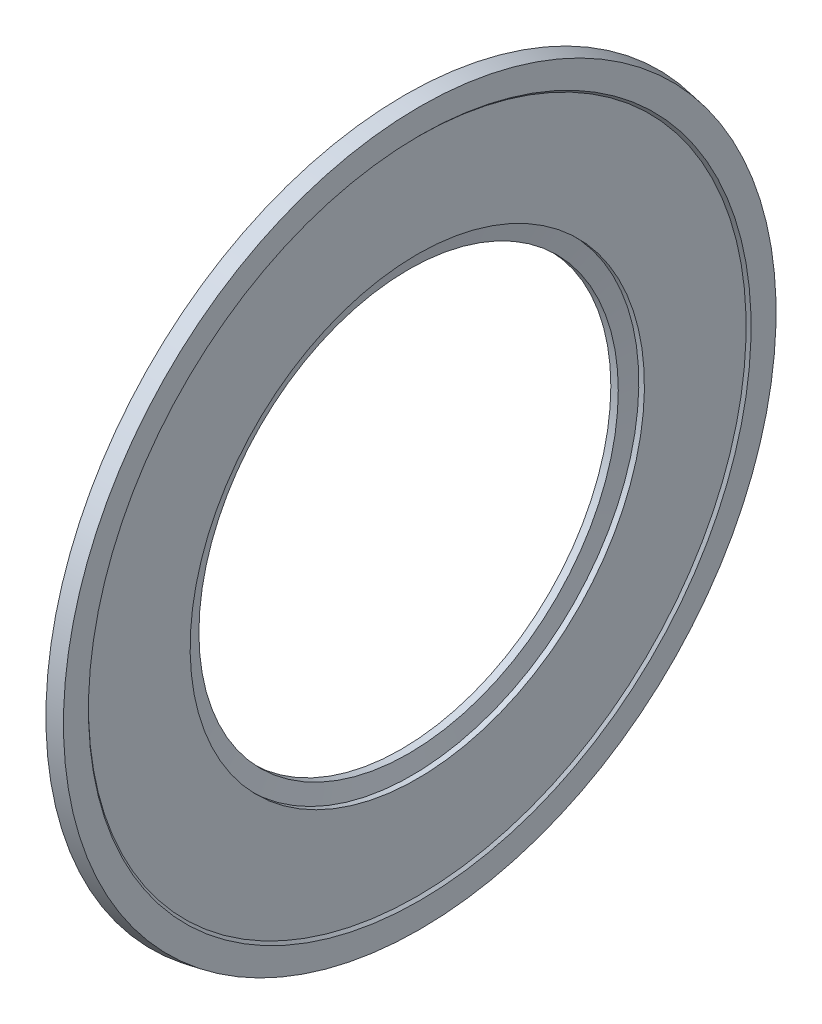
ISO-10303-21;
HEADER;
FILE_DESCRIPTION(('STEP AP214'),'2;1');
FILE_NAME('part.step','',(''),(''),'','','');
FILE_SCHEMA(('AUTOMOTIVE_DESIGN { 1 0 10303 214 1 1 1 1 }'));
ENDSEC;
DATA;
#1=APPLICATION_CONTEXT('core data for automotive mechanical design processes');
#2=APPLICATION_PROTOCOL_DEFINITION('international standard','automotive_design',2000,#1);
#3=PRODUCT_CONTEXT('',#1,'mechanical');
#4=PRODUCT('Part','Part','',(#3));
#5=PRODUCT_RELATED_PRODUCT_CATEGORY('part','',(#4));
#6=PRODUCT_DEFINITION_FORMATION('','',#4);
#7=PRODUCT_DEFINITION_CONTEXT('part definition',#1,'design');
#8=PRODUCT_DEFINITION('design','',#6,#7);
#9=PRODUCT_DEFINITION_SHAPE('','',#8);
#10=(LENGTH_UNIT() NAMED_UNIT(*) SI_UNIT(.MILLI.,.METRE.));
#11=(NAMED_UNIT(*) PLANE_ANGLE_UNIT() SI_UNIT($,.RADIAN.));
#12=(NAMED_UNIT(*) SI_UNIT($,.STERADIAN.) SOLID_ANGLE_UNIT());
#13=UNCERTAINTY_MEASURE_WITH_UNIT(LENGTH_MEASURE(1.E-05),#10,'distance_accuracy_value','');
#14=(GEOMETRIC_REPRESENTATION_CONTEXT(3) GLOBAL_UNCERTAINTY_ASSIGNED_CONTEXT((#13)) GLOBAL_UNIT_ASSIGNED_CONTEXT((#10,
#11,#12)) REPRESENTATION_CONTEXT('',''));
#15=CARTESIAN_POINT('',(0.,0.,0.));
#16=DIRECTION('',(0.,0.,1.));
#17=DIRECTION('',(1.,0.,0.));
#18=AXIS2_PLACEMENT_3D('',#15,#16,#17);
#19=CARTESIAN_POINT('',(0.232,8.20523785952436,0.));
#20=DIRECTION('',(-1.,0.,0.));
#21=DIRECTION('',(0.,-1.,0.));
#22=AXIS2_PLACEMENT_3D('',#19,#20,#21);
#23=PLANE('',#22);
#24=CARTESIAN_POINT('',(0.232,0.,0.));
#25=DIRECTION('',(1.,0.,0.));
#26=DIRECTION('',(0.,1.,0.));
#27=AXIS2_PLACEMENT_3D('',#24,#25,#26);
#28=CIRCLE('',#27,8.03123785952436);
#29=CARTESIAN_POINT('',(0.232,8.03123785952436,0.));
#30=VERTEX_POINT('',#29);
#31=EDGE_CURVE('E11',#30,#30,#28,.T.);
#32=ORIENTED_EDGE('',*,*,#31,.T.);
#33=EDGE_LOOP('',(#32));
#34=FACE_BOUND('',#33,.T.);
#35=CARTESIAN_POINT('',(0.232,0.,0.));
#36=DIRECTION('',(1.,0.,0.));
#37=DIRECTION('',(0.,1.,0.));
#38=AXIS2_PLACEMENT_3D('',#35,#36,#37);
#39=CIRCLE('',#38,8.37923785952436);
#40=CARTESIAN_POINT('',(0.232,8.37923785952436,0.));
#41=VERTEX_POINT('',#40);
#42=EDGE_CURVE('E72',#41,#41,#39,.T.);
#43=ORIENTED_EDGE('',*,*,#42,.F.);
#44=EDGE_LOOP('',(#43));
#45=FACE_BOUND('',#44,.T.);
#46=ADVANCED_FACE('F16',(#34,#45),#23,.T.);
#47=CARTESIAN_POINT('',(0.174,0.,0.));
#48=DIRECTION('',(1.,0.,0.));
#49=DIRECTION('',(0.,1.,0.));
#50=AXIS2_PLACEMENT_3D('',#47,#48,#49);
#51=CONICAL_SURFACE('',#50,7.97323785952436,0.785398163397449);
#52=CARTESIAN_POINT('',(0.116,0.,0.));
#53=DIRECTION('',(1.,0.,0.));
#54=DIRECTION('',(0.,1.,0.));
#55=AXIS2_PLACEMENT_3D('',#52,#53,#54);
#56=CIRCLE('',#55,7.91523785952436);
#57=CARTESIAN_POINT('',(0.116,7.91523785952436,0.));
#58=VERTEX_POINT('',#57);
#59=EDGE_CURVE('E26',#58,#58,#56,.T.);
#60=ORIENTED_EDGE('',*,*,#59,.T.);
#61=EDGE_LOOP('',(#60));
#62=FACE_BOUND('',#61,.T.);
#63=ORIENTED_EDGE('',*,*,#31,.F.);
#64=EDGE_LOOP('',(#63));
#65=FACE_BOUND('',#64,.T.);
#66=ADVANCED_FACE('F113',(#62,#65),#51,.T.);
#67=CARTESIAN_POINT('',(0.116,6.60886892976218,0.));
#68=DIRECTION('',(-1.,0.,0.));
#69=DIRECTION('',(0.,-1.,0.));
#70=AXIS2_PLACEMENT_3D('',#67,#68,#69);
#71=PLANE('',#70);
#72=CARTESIAN_POINT('',(0.116,0.,0.));
#73=DIRECTION('',(1.,0.,0.));
#74=DIRECTION('',(0.,1.,0.));
#75=AXIS2_PLACEMENT_3D('',#72,#73,#74);
#76=CIRCLE('',#75,5.3025);
#77=CARTESIAN_POINT('',(0.116,5.3025,0.));
#78=VERTEX_POINT('',#77);
#79=EDGE_CURVE('E48',#78,#78,#76,.T.);
#80=ORIENTED_EDGE('',*,*,#79,.T.);
#81=EDGE_LOOP('',(#80));
#82=FACE_BOUND('',#81,.T.);
#83=ORIENTED_EDGE('',*,*,#59,.F.);
#84=EDGE_LOOP('',(#83));
#85=FACE_BOUND('',#84,.T.);
#86=ADVANCED_FACE('F118',(#82,#85),#71,.T.);
#87=CARTESIAN_POINT('',(0.161759388986371,0.,0.));
#88=DIRECTION('',(-1.,0.,0.));
#89=DIRECTION('',(0.,1.,0.));
#90=AXIS2_PLACEMENT_3D('',#87,#88,#89);
#91=CONICAL_SURFACE('',#90,5.27608080445077,0.523598775598299);
#92=CARTESIAN_POINT('',(0.207518777972743,0.,0.));
#93=DIRECTION('',(1.,0.,0.));
#94=DIRECTION('',(0.,1.,0.));
#95=AXIS2_PLACEMENT_3D('',#92,#93,#94);
#96=CIRCLE('',#95,5.24966160890153);
#97=CARTESIAN_POINT('',(0.207518777972743,5.24966160890153,0.));
#98=VERTEX_POINT('',#97);
#99=EDGE_CURVE('E53',#98,#98,#96,.T.);
#100=ORIENTED_EDGE('',*,*,#99,.T.);
#101=EDGE_LOOP('',(#100));
#102=FACE_BOUND('',#101,.T.);
#103=ORIENTED_EDGE('',*,*,#79,.F.);
#104=EDGE_LOOP('',(#103));
#105=FACE_BOUND('',#104,.T.);
#106=ADVANCED_FACE('F124',(#102,#105),#91,.F.);
#107=CARTESIAN_POINT('',(0.176259388986372,0.,0.));
#108=DIRECTION('',(1.,0.,0.));
#109=DIRECTION('',(0.,1.,0.));
#110=AXIS2_PLACEMENT_3D('',#107,#108,#109);
#111=CONICAL_SURFACE('',#110,5.07238080445077,1.39626340159546);
#112=CARTESIAN_POINT('',(0.145,0.,0.));
#113=DIRECTION('',(1.,0.,0.));
#114=DIRECTION('',(0.,1.,0.));
#115=AXIS2_PLACEMENT_3D('',#112,#113,#114);
#116=CIRCLE('',#115,4.8951);
#117=CARTESIAN_POINT('',(0.145,4.8951,0.));
#118=VERTEX_POINT('',#117);
#119=EDGE_CURVE('E20',#118,#118,#116,.T.);
#120=ORIENTED_EDGE('',*,*,#119,.T.);
#121=EDGE_LOOP('',(#120));
#122=FACE_BOUND('',#121,.T.);
#123=ORIENTED_EDGE('',*,*,#99,.F.);
#124=EDGE_LOOP('',(#123));
#125=FACE_BOUND('',#124,.T.);
#126=ADVANCED_FACE('F127',(#122,#125),#111,.T.);
#127=CARTESIAN_POINT('',(0.232,0.,0.));
#128=DIRECTION('',(-1.,0.,0.));
#129=DIRECTION('',(0.,1.,0.));
#130=AXIS2_PLACEMENT_3D('',#127,#128,#129);
#131=CYLINDRICAL_SURFACE('',#130,4.8951);
#132=CARTESIAN_POINT('',(0.319,0.,0.));
#133=DIRECTION('',(1.,0.,0.));
#134=DIRECTION('',(0.,1.,0.));
#135=AXIS2_PLACEMENT_3D('',#132,#133,#134);
#136=CIRCLE('',#135,4.8951);
#137=CARTESIAN_POINT('',(0.319,4.8951,0.));
#138=VERTEX_POINT('',#137);
#139=EDGE_CURVE('E89',#138,#138,#136,.T.);
#140=ORIENTED_EDGE('',*,*,#139,.T.);
#141=EDGE_LOOP('',(#140));
#142=FACE_BOUND('',#141,.T.);
#143=ORIENTED_EDGE('',*,*,#119,.F.);
#144=EDGE_LOOP('',(#143));
#145=FACE_BOUND('',#144,.T.);
#146=ADVANCED_FACE('F109',(#142,#145),#131,.F.);
#147=CARTESIAN_POINT('',(0.354917805970314,0.,0.));
#148=DIRECTION('',(1.,0.,0.));
#149=DIRECTION('',(0.,1.,0.));
#150=AXIS2_PLACEMENT_3D('',#147,#148,#149);
#151=CONICAL_SURFACE('',#150,5.0988,1.39626340159546);
#152=CARTESIAN_POINT('',(0.390835611940629,0.,0.));
#153=DIRECTION('',(1.,0.,0.));
#154=DIRECTION('',(0.,1.,0.));
#155=AXIS2_PLACEMENT_3D('',#152,#153,#154);
#156=CIRCLE('',#155,5.3025);
#157=CARTESIAN_POINT('',(0.390835611940629,5.3025,0.));
#158=VERTEX_POINT('',#157);
#159=EDGE_CURVE('E86',#158,#158,#156,.T.);
#160=ORIENTED_EDGE('',*,*,#159,.T.);
#161=EDGE_LOOP('',(#160));
#162=FACE_BOUND('',#161,.T.);
#163=ORIENTED_EDGE('',*,*,#139,.F.);
#164=EDGE_LOOP('',(#163));
#165=FACE_BOUND('',#164,.T.);
#166=ADVANCED_FACE('F18',(#162,#165),#151,.F.);
#167=CARTESIAN_POINT('',(0.456417805970314,0.,0.));
#168=DIRECTION('',(-1.,0.,0.));
#169=DIRECTION('',(0.,1.,0.));
#170=AXIS2_PLACEMENT_3D('',#167,#168,#169);
#171=CYLINDRICAL_SURFACE('',#170,5.3025);
#172=CARTESIAN_POINT('',(0.522,0.,0.));
#173=DIRECTION('',(1.,0.,0.));
#174=DIRECTION('',(0.,1.,0.));
#175=AXIS2_PLACEMENT_3D('',#172,#173,#174);
#176=CIRCLE('',#175,5.3025);
#177=CARTESIAN_POINT('',(0.522,5.3025,0.));
#178=VERTEX_POINT('',#177);
#179=EDGE_CURVE('E82',#178,#178,#176,.T.);
#180=ORIENTED_EDGE('',*,*,#179,.T.);
#181=EDGE_LOOP('',(#180));
#182=FACE_BOUND('',#181,.T.);
#183=ORIENTED_EDGE('',*,*,#159,.F.);
#184=EDGE_LOOP('',(#183));
#185=FACE_BOUND('',#184,.T.);
#186=ADVANCED_FACE('F98',(#182,#185),#171,.F.);
#187=CARTESIAN_POINT('',(0.522,6.4895,0.));
#188=DIRECTION('',(1.,0.,0.));
#189=DIRECTION('',(0.,1.,0.));
#190=AXIS2_PLACEMENT_3D('',#187,#188,#189);
#191=PLANE('',#190);
#192=CARTESIAN_POINT('',(0.522,0.,0.));
#193=DIRECTION('',(1.,0.,0.));
#194=DIRECTION('',(0.,1.,0.));
#195=AXIS2_PLACEMENT_3D('',#192,#193,#194);
#196=CIRCLE('',#195,7.6765);
#197=CARTESIAN_POINT('',(0.522,7.6765,0.));
#198=VERTEX_POINT('',#197);
#199=EDGE_CURVE('E79',#198,#198,#196,.T.);
#200=ORIENTED_EDGE('',*,*,#199,.T.);
#201=EDGE_LOOP('',(#200));
#202=FACE_BOUND('',#201,.T.);
#203=ORIENTED_EDGE('',*,*,#179,.F.);
#204=EDGE_LOOP('',(#203));
#205=FACE_BOUND('',#204,.T.);
#206=ADVANCED_FACE('F100',(#202,#205),#191,.T.);
#207=CARTESIAN_POINT('',(0.551,0.,0.));
#208=DIRECTION('',(1.,0.,0.));
#209=DIRECTION('',(0.,1.,0.));
#210=AXIS2_PLACEMENT_3D('',#207,#208,#209);
#211=CONICAL_SURFACE('',#210,7.7055,0.785398163397451);
#212=CARTESIAN_POINT('',(0.58,0.,0.));
#213=DIRECTION('',(1.,0.,0.));
#214=DIRECTION('',(0.,1.,0.));
#215=AXIS2_PLACEMENT_3D('',#212,#213,#214);
#216=CIRCLE('',#215,7.7345);
#217=CARTESIAN_POINT('',(0.58,7.7345,0.));
#218=VERTEX_POINT('',#217);
#219=EDGE_CURVE('E74',#218,#218,#216,.T.);
#220=ORIENTED_EDGE('',*,*,#219,.T.);
#221=EDGE_LOOP('',(#220));
#222=FACE_BOUND('',#221,.T.);
#223=ORIENTED_EDGE('',*,*,#199,.F.);
#224=EDGE_LOOP('',(#223));
#225=FACE_BOUND('',#224,.T.);
#226=ADVANCED_FACE('F108',(#222,#225),#211,.F.);
#227=CARTESIAN_POINT('',(0.58,8.02618803511891,0.));
#228=DIRECTION('',(1.,0.,0.));
#229=DIRECTION('',(0.,1.,0.));
#230=AXIS2_PLACEMENT_3D('',#227,#228,#229);
#231=PLANE('',#230);
#232=CARTESIAN_POINT('',(0.58,0.,0.));
#233=DIRECTION('',(1.,0.,0.));
#234=DIRECTION('',(0.,1.,0.));
#235=AXIS2_PLACEMENT_3D('',#232,#233,#234);
#236=CIRCLE('',#235,8.31787607023782);
#237=CARTESIAN_POINT('',(0.58,8.31787607023782,0.));
#238=VERTEX_POINT('',#237);
#239=EDGE_CURVE('E68',#238,#238,#236,.T.);
#240=ORIENTED_EDGE('',*,*,#239,.T.);
#241=EDGE_LOOP('',(#240));
#242=FACE_BOUND('',#241,.T.);
#243=ORIENTED_EDGE('',*,*,#219,.F.);
#244=EDGE_LOOP('',(#243));
#245=FACE_BOUND('',#244,.T.);
#246=ADVANCED_FACE('F69',(#242,#245),#231,.T.);
#247=CARTESIAN_POINT('',(0.406,0.,0.));
#248=DIRECTION('',(-1.,0.,0.));
#249=DIRECTION('',(0.,1.,0.));
#250=AXIS2_PLACEMENT_3D('',#247,#248,#249);
#251=CONICAL_SURFACE('',#250,8.34855696488109,0.174532925199437);
#252=ORIENTED_EDGE('',*,*,#42,.T.);
#253=EDGE_LOOP('',(#252));
#254=FACE_BOUND('',#253,.T.);
#255=ORIENTED_EDGE('',*,*,#239,.F.);
#256=EDGE_LOOP('',(#255));
#257=FACE_BOUND('',#256,.T.);
#258=ADVANCED_FACE('F130',(#254,#257),#251,.T.);
#259=CLOSED_SHELL('',(#46,#66,#86,#106,#126,#146,#166,#186,#206,#226,#246,#258));
#260=MANIFOLD_SOLID_BREP('B1',#259);
#261=ADVANCED_BREP_SHAPE_REPRESENTATION('',(#18,#260),#14);
#262=SHAPE_DEFINITION_REPRESENTATION(#9,#261);
ENDSEC;
END-ISO-10303-21;
